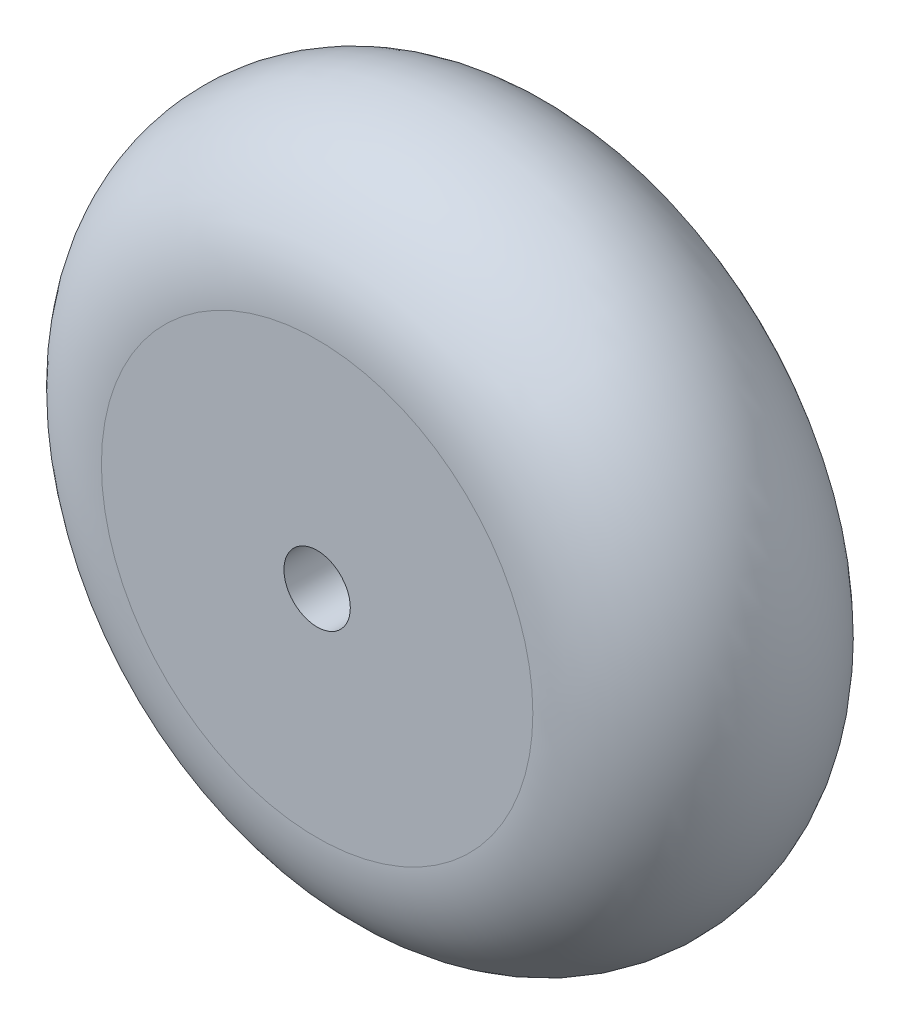
ISO-10303-21;
HEADER;
FILE_DESCRIPTION(('STEP AP214'),'2;1');
FILE_NAME('part.step','',(''),(''),'','','');
FILE_SCHEMA(('AUTOMOTIVE_DESIGN { 1 0 10303 214 1 1 1 1 }'));
ENDSEC;
DATA;
#1=APPLICATION_CONTEXT('core data for automotive mechanical design processes');
#2=APPLICATION_PROTOCOL_DEFINITION('international standard','automotive_design',2000,#1);
#3=PRODUCT_CONTEXT('',#1,'mechanical');
#4=PRODUCT('Part','Part','',(#3));
#5=PRODUCT_RELATED_PRODUCT_CATEGORY('part','',(#4));
#6=PRODUCT_DEFINITION_FORMATION('','',#4);
#7=PRODUCT_DEFINITION_CONTEXT('part definition',#1,'design');
#8=PRODUCT_DEFINITION('design','',#6,#7);
#9=PRODUCT_DEFINITION_SHAPE('','',#8);
#10=(LENGTH_UNIT() NAMED_UNIT(*) SI_UNIT(.MILLI.,.METRE.));
#11=(NAMED_UNIT(*) PLANE_ANGLE_UNIT() SI_UNIT($,.RADIAN.));
#12=(NAMED_UNIT(*) SI_UNIT($,.STERADIAN.) SOLID_ANGLE_UNIT());
#13=UNCERTAINTY_MEASURE_WITH_UNIT(LENGTH_MEASURE(1.E-05),#10,'distance_accuracy_value','');
#14=(GEOMETRIC_REPRESENTATION_CONTEXT(3) GLOBAL_UNCERTAINTY_ASSIGNED_CONTEXT((#13)) GLOBAL_UNIT_ASSIGNED_CONTEXT((#10,
#11,#12)) REPRESENTATION_CONTEXT('',''));
#15=CARTESIAN_POINT('',(0.,0.,0.));
#16=DIRECTION('',(0.,0.,1.));
#17=DIRECTION('',(1.,0.,0.));
#18=AXIS2_PLACEMENT_3D('',#15,#16,#17);
#19=CARTESIAN_POINT('',(0.,0.,12.));
#20=DIRECTION('',(0.,0.,1.));
#21=DIRECTION('',(1.,0.,0.));
#22=AXIS2_PLACEMENT_3D('',#19,#20,#21);
#23=TOROIDAL_SURFACE('',#22,19.5,12.);
#24=CARTESIAN_POINT('',(0.,0.,24.));
#25=DIRECTION('',(0.,0.,1.));
#26=DIRECTION('',(1.,0.,0.));
#27=AXIS2_PLACEMENT_3D('',#24,#25,#26);
#28=CIRCLE('',#27,19.5);
#29=CARTESIAN_POINT('',(19.5,0.,24.));
#30=VERTEX_POINT('',#29);
#31=EDGE_CURVE('E11',#30,#30,#28,.T.);
#32=ORIENTED_EDGE('',*,*,#31,.F.);
#33=EDGE_LOOP('',(#32));
#34=FACE_BOUND('',#33,.T.);
#35=CARTESIAN_POINT('',(0.,0.,0.));
#36=DIRECTION('',(0.,0.,1.));
#37=DIRECTION('',(1.,0.,0.));
#38=AXIS2_PLACEMENT_3D('',#35,#36,#37);
#39=CIRCLE('',#38,19.5);
#40=CARTESIAN_POINT('',(19.5,0.,0.));
#41=VERTEX_POINT('',#40);
#42=EDGE_CURVE('E53',#41,#41,#39,.T.);
#43=ORIENTED_EDGE('',*,*,#42,.T.);
#44=EDGE_LOOP('',(#43));
#45=FACE_BOUND('',#44,.T.);
#46=ADVANCED_FACE('F47',(#34,#45),#23,.T.);
#47=CARTESIAN_POINT('',(0.,0.,38.2736617203616));
#48=DIRECTION('',(0.,0.,1.));
#49=DIRECTION('',(1.,0.,0.));
#50=AXIS2_PLACEMENT_3D('',#47,#48,#49);
#51=CYLINDRICAL_SURFACE('',#50,19.5);
#52=ORIENTED_EDGE('',*,*,#42,.F.);
#53=EDGE_LOOP('',(#52));
#54=FACE_BOUND('',#53,.T.);
#55=ORIENTED_EDGE('',*,*,#31,.T.);
#56=EDGE_LOOP('',(#55));
#57=FACE_BOUND('',#56,.T.);
#58=ADVANCED_FACE('F60',(#54,#57),#51,.F.);
#59=CLOSED_SHELL('',(#46,#58));
#60=MANIFOLD_SOLID_BREP('B2',#59);
#61=CARTESIAN_POINT('',(0.,0.,24.));
#62=DIRECTION('',(0.,0.,-1.));
#63=DIRECTION('',(-1.,0.,0.));
#64=AXIS2_PLACEMENT_3D('',#61,#62,#63);
#65=CYLINDRICAL_SURFACE('',#64,19.5);
#66=CARTESIAN_POINT('',(0.,0.,24.));
#67=DIRECTION('',(0.,0.,1.));
#68=DIRECTION('',(1.,0.,0.));
#69=AXIS2_PLACEMENT_3D('',#66,#67,#68);
#70=CIRCLE('',#69,19.5);
#71=CARTESIAN_POINT('',(19.5,0.,24.));
#72=VERTEX_POINT('',#71);
#73=EDGE_CURVE('E46',#72,#72,#70,.T.);
#74=ORIENTED_EDGE('',*,*,#73,.F.);
#75=EDGE_LOOP('',(#74));
#76=FACE_BOUND('',#75,.T.);
#77=CARTESIAN_POINT('',(0.,0.,0.));
#78=DIRECTION('',(0.,0.,1.));
#79=DIRECTION('',(1.,0.,0.));
#80=AXIS2_PLACEMENT_3D('',#77,#78,#79);
#81=CIRCLE('',#80,19.5);
#82=CARTESIAN_POINT('',(19.5,0.,0.));
#83=VERTEX_POINT('',#82);
#84=EDGE_CURVE('E86',#83,#83,#81,.T.);
#85=ORIENTED_EDGE('',*,*,#84,.T.);
#86=EDGE_LOOP('',(#85));
#87=FACE_BOUND('',#86,.T.);
#88=ADVANCED_FACE('F83',(#76,#87),#65,.T.);
#89=CARTESIAN_POINT('',(0.,0.,24.));
#90=DIRECTION('',(0.,0.,1.));
#91=DIRECTION('',(1.,0.,0.));
#92=AXIS2_PLACEMENT_3D('',#89,#90,#91);
#93=PLANE('',#92);
#94=CARTESIAN_POINT('',(0.,0.,24.));
#95=DIRECTION('',(0.,0.,1.));
#96=DIRECTION('',(1.,0.,0.));
#97=AXIS2_PLACEMENT_3D('',#94,#95,#96);
#98=CIRCLE('',#97,3.);
#99=CARTESIAN_POINT('',(3.,0.,24.));
#100=VERTEX_POINT('',#99);
#101=EDGE_CURVE('E93',#100,#100,#98,.T.);
#102=ORIENTED_EDGE('',*,*,#101,.F.);
#103=EDGE_LOOP('',(#102));
#104=FACE_BOUND('',#103,.T.);
#105=ORIENTED_EDGE('',*,*,#73,.T.);
#106=EDGE_LOOP('',(#105));
#107=FACE_BOUND('',#106,.T.);
#108=ADVANCED_FACE('F111',(#104,#107),#93,.T.);
#109=CARTESIAN_POINT('',(0.,0.,0.));
#110=DIRECTION('',(0.,0.,1.));
#111=DIRECTION('',(1.,0.,0.));
#112=AXIS2_PLACEMENT_3D('',#109,#110,#111);
#113=PLANE('',#112);
#114=CARTESIAN_POINT('',(0.,0.,0.));
#115=DIRECTION('',(0.,0.,1.));
#116=DIRECTION('',(1.,0.,0.));
#117=AXIS2_PLACEMENT_3D('',#114,#115,#116);
#118=CIRCLE('',#117,3.);
#119=CARTESIAN_POINT('',(3.,0.,0.));
#120=VERTEX_POINT('',#119);
#121=EDGE_CURVE('E97',#120,#120,#118,.T.);
#122=ORIENTED_EDGE('',*,*,#121,.T.);
#123=EDGE_LOOP('',(#122));
#124=FACE_BOUND('',#123,.T.);
#125=ORIENTED_EDGE('',*,*,#84,.F.);
#126=EDGE_LOOP('',(#125));
#127=FACE_BOUND('',#126,.T.);
#128=ADVANCED_FACE('F101',(#124,#127),#113,.F.);
#129=CARTESIAN_POINT('',(0.,0.,0.));
#130=DIRECTION('',(0.,0.,1.));
#131=DIRECTION('',(1.,0.,0.));
#132=AXIS2_PLACEMENT_3D('',#129,#130,#131);
#133=CYLINDRICAL_SURFACE('',#132,3.);
#134=ORIENTED_EDGE('',*,*,#101,.T.);
#135=EDGE_LOOP('',(#134));
#136=FACE_BOUND('',#135,.T.);
#137=ORIENTED_EDGE('',*,*,#121,.F.);
#138=EDGE_LOOP('',(#137));
#139=FACE_BOUND('',#138,.T.);
#140=ADVANCED_FACE('F104',(#136,#139),#133,.F.);
#141=CLOSED_SHELL('',(#88,#108,#128,#140));
#142=MANIFOLD_SOLID_BREP('B6',#141);
#143=ADVANCED_BREP_SHAPE_REPRESENTATION('',(#18,#60,#142),#14);
#144=SHAPE_DEFINITION_REPRESENTATION(#9,#143);
ENDSEC;
END-ISO-10303-21;
